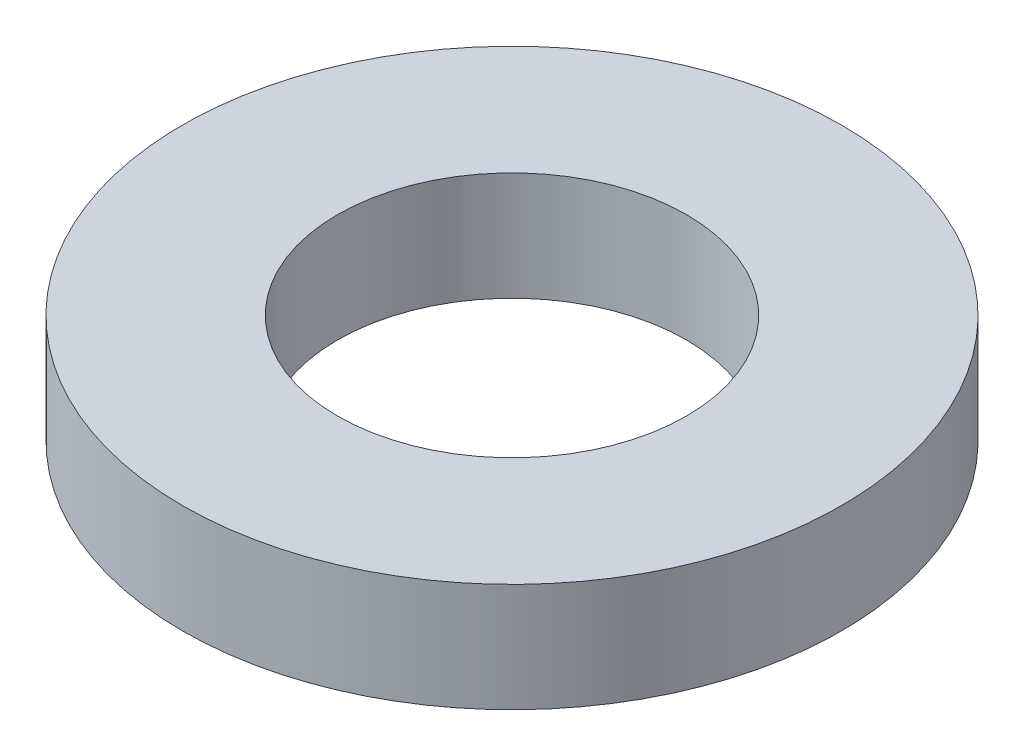
ISO-10303-21;
HEADER;
FILE_DESCRIPTION(('STEP AP214'),'2;1');
FILE_NAME('part.step','',(''),(''),'','','');
FILE_SCHEMA(('AUTOMOTIVE_DESIGN { 1 0 10303 214 1 1 1 1 }'));
ENDSEC;
DATA;
#1=APPLICATION_CONTEXT('core data for automotive mechanical design processes');
#2=APPLICATION_PROTOCOL_DEFINITION('international standard','automotive_design',2000,#1);
#3=PRODUCT_CONTEXT('',#1,'mechanical');
#4=PRODUCT('Part','Part','',(#3));
#5=PRODUCT_RELATED_PRODUCT_CATEGORY('part','',(#4));
#6=PRODUCT_DEFINITION_FORMATION('','',#4);
#7=PRODUCT_DEFINITION_CONTEXT('part definition',#1,'design');
#8=PRODUCT_DEFINITION('design','',#6,#7);
#9=PRODUCT_DEFINITION_SHAPE('','',#8);
#10=(LENGTH_UNIT() NAMED_UNIT(*) SI_UNIT(.MILLI.,.METRE.));
#11=(NAMED_UNIT(*) PLANE_ANGLE_UNIT() SI_UNIT($,.RADIAN.));
#12=(NAMED_UNIT(*) SI_UNIT($,.STERADIAN.) SOLID_ANGLE_UNIT());
#13=UNCERTAINTY_MEASURE_WITH_UNIT(LENGTH_MEASURE(1.E-05),#10,'distance_accuracy_value','');
#14=(GEOMETRIC_REPRESENTATION_CONTEXT(3) GLOBAL_UNCERTAINTY_ASSIGNED_CONTEXT((#13)) GLOBAL_UNIT_ASSIGNED_CONTEXT((#10,
#11,#12)) REPRESENTATION_CONTEXT('',''));
#15=CARTESIAN_POINT('',(0.,0.,0.));
#16=DIRECTION('',(0.,0.,1.));
#17=DIRECTION('',(1.,0.,0.));
#18=AXIS2_PLACEMENT_3D('',#15,#16,#17);
#19=CARTESIAN_POINT('',(0.,14.,0.));
#20=DIRECTION('',(0.,-1.,0.));
#21=DIRECTION('',(0.,0.,-1.));
#22=AXIS2_PLACEMENT_3D('',#19,#20,#21);
#23=CYLINDRICAL_SURFACE('',#22,42.5);
#24=CARTESIAN_POINT('',(0.,14.,0.));
#25=DIRECTION('',(0.,1.,0.));
#26=DIRECTION('',(0.,0.,1.));
#27=AXIS2_PLACEMENT_3D('',#24,#25,#26);
#28=CIRCLE('',#27,42.5);
#29=CARTESIAN_POINT('',(0.,14.,42.5));
#30=VERTEX_POINT('',#29);
#31=EDGE_CURVE('E10',#30,#30,#28,.T.);
#32=ORIENTED_EDGE('',*,*,#31,.F.);
#33=EDGE_LOOP('',(#32));
#34=FACE_BOUND('',#33,.T.);
#35=CARTESIAN_POINT('',(0.,0.,0.));
#36=DIRECTION('',(0.,1.,0.));
#37=DIRECTION('',(0.,0.,1.));
#38=AXIS2_PLACEMENT_3D('',#35,#36,#37);
#39=CIRCLE('',#38,42.5);
#40=CARTESIAN_POINT('',(0.,0.,42.5));
#41=VERTEX_POINT('',#40);
#42=EDGE_CURVE('E37',#41,#41,#39,.T.);
#43=ORIENTED_EDGE('',*,*,#42,.T.);
#44=EDGE_LOOP('',(#43));
#45=FACE_BOUND('',#44,.T.);
#46=ADVANCED_FACE('F40',(#34,#45),#23,.T.);
#47=CARTESIAN_POINT('',(0.,14.,0.));
#48=DIRECTION('',(0.,1.,0.));
#49=DIRECTION('',(0.,0.,1.));
#50=AXIS2_PLACEMENT_3D('',#47,#48,#49);
#51=PLANE('',#50);
#52=CARTESIAN_POINT('',(0.,14.,0.));
#53=DIRECTION('',(0.,1.,0.));
#54=DIRECTION('',(0.,0.,1.));
#55=AXIS2_PLACEMENT_3D('',#52,#53,#54);
#56=CIRCLE('',#55,22.5);
#57=CARTESIAN_POINT('',(0.,14.,22.5));
#58=VERTEX_POINT('',#57);
#59=EDGE_CURVE('E50',#58,#58,#56,.T.);
#60=ORIENTED_EDGE('',*,*,#59,.F.);
#61=EDGE_LOOP('',(#60));
#62=FACE_BOUND('',#61,.T.);
#63=ORIENTED_EDGE('',*,*,#31,.T.);
#64=EDGE_LOOP('',(#63));
#65=FACE_BOUND('',#64,.T.);
#66=ADVANCED_FACE('F59',(#62,#65),#51,.T.);
#67=CARTESIAN_POINT('',(0.,0.,0.));
#68=DIRECTION('',(0.,1.,0.));
#69=DIRECTION('',(0.,0.,1.));
#70=AXIS2_PLACEMENT_3D('',#67,#68,#69);
#71=PLANE('',#70);
#72=CARTESIAN_POINT('',(0.,0.,0.));
#73=DIRECTION('',(0.,1.,0.));
#74=DIRECTION('',(0.,0.,1.));
#75=AXIS2_PLACEMENT_3D('',#72,#73,#74);
#76=CIRCLE('',#75,22.5);
#77=CARTESIAN_POINT('',(0.,0.,22.5));
#78=VERTEX_POINT('',#77);
#79=EDGE_CURVE('E47',#78,#78,#76,.T.);
#80=ORIENTED_EDGE('',*,*,#79,.T.);
#81=EDGE_LOOP('',(#80));
#82=FACE_BOUND('',#81,.T.);
#83=ORIENTED_EDGE('',*,*,#42,.F.);
#84=EDGE_LOOP('',(#83));
#85=FACE_BOUND('',#84,.T.);
#86=ADVANCED_FACE('F58',(#82,#85),#71,.F.);
#87=CARTESIAN_POINT('',(0.,14.,0.));
#88=DIRECTION('',(0.,-1.,0.));
#89=DIRECTION('',(0.,0.,-1.));
#90=AXIS2_PLACEMENT_3D('',#87,#88,#89);
#91=CYLINDRICAL_SURFACE('',#90,22.5);
#92=ORIENTED_EDGE('',*,*,#59,.T.);
#93=EDGE_LOOP('',(#92));
#94=FACE_BOUND('',#93,.T.);
#95=ORIENTED_EDGE('',*,*,#79,.F.);
#96=EDGE_LOOP('',(#95));
#97=FACE_BOUND('',#96,.T.);
#98=ADVANCED_FACE('F54',(#94,#97),#91,.F.);
#99=CLOSED_SHELL('',(#46,#66,#86,#98));
#100=MANIFOLD_SOLID_BREP('B2',#99);
#101=ADVANCED_BREP_SHAPE_REPRESENTATION('',(#18,#100),#14);
#102=SHAPE_DEFINITION_REPRESENTATION(#9,#101);
ENDSEC;
END-ISO-10303-21;
